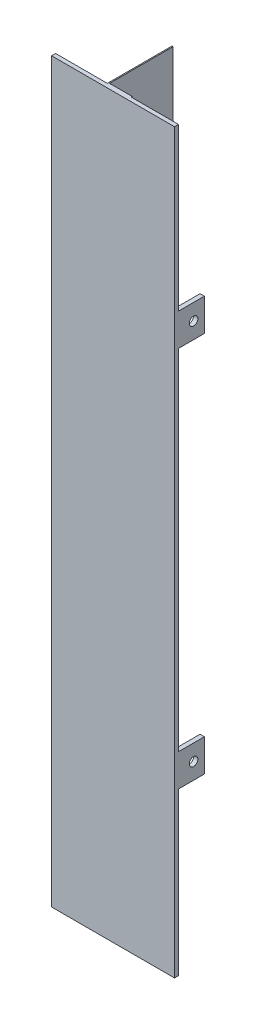
ISO-10303-21;
HEADER;
FILE_DESCRIPTION(('STEP AP214'),'2;1');
FILE_NAME('part.step','',(''),(''),'','','');
FILE_SCHEMA(('AUTOMOTIVE_DESIGN { 1 0 10303 214 1 1 1 1 }'));
ENDSEC;
DATA;
#1=APPLICATION_CONTEXT('core data for automotive mechanical design processes');
#2=APPLICATION_PROTOCOL_DEFINITION('international standard','automotive_design',2000,#1);
#3=PRODUCT_CONTEXT('',#1,'mechanical');
#4=PRODUCT('Part','Part','',(#3));
#5=PRODUCT_RELATED_PRODUCT_CATEGORY('part','',(#4));
#6=PRODUCT_DEFINITION_FORMATION('','',#4);
#7=PRODUCT_DEFINITION_CONTEXT('part definition',#1,'design');
#8=PRODUCT_DEFINITION('design','',#6,#7);
#9=PRODUCT_DEFINITION_SHAPE('','',#8);
#10=(LENGTH_UNIT() NAMED_UNIT(*) SI_UNIT(.MILLI.,.METRE.));
#11=(NAMED_UNIT(*) PLANE_ANGLE_UNIT() SI_UNIT($,.RADIAN.));
#12=(NAMED_UNIT(*) SI_UNIT($,.STERADIAN.) SOLID_ANGLE_UNIT());
#13=UNCERTAINTY_MEASURE_WITH_UNIT(LENGTH_MEASURE(1.E-05),#10,'distance_accuracy_value','');
#14=(GEOMETRIC_REPRESENTATION_CONTEXT(3) GLOBAL_UNCERTAINTY_ASSIGNED_CONTEXT((#13)) GLOBAL_UNIT_ASSIGNED_CONTEXT((#10,
#11,#12)) REPRESENTATION_CONTEXT('',''));
#15=CARTESIAN_POINT('',(0.,0.,0.));
#16=DIRECTION('',(0.,0.,1.));
#17=DIRECTION('',(1.,0.,0.));
#18=AXIS2_PLACEMENT_3D('',#15,#16,#17);
#19=CARTESIAN_POINT('',(0.,342.,-1.85));
#20=DIRECTION('',(0.,0.,1.));
#21=DIRECTION('',(1.,0.,0.));
#22=AXIS2_PLACEMENT_3D('',#19,#20,#21);
#23=PLANE('',#22);
#24=DIRECTION('',(1.,0.,0.));
#25=VECTOR('',#24,1.);
#26=CARTESIAN_POINT('',(0.,267.,-1.85));
#27=LINE('',#26,#25);
#28=CARTESIAN_POINT('',(0.,267.,-1.85));
#29=VERTEX_POINT('',#28);
#30=CARTESIAN_POINT('',(2.,267.,-1.85));
#31=VERTEX_POINT('',#30);
#32=EDGE_CURVE('E398',#29,#31,#27,.T.);
#33=ORIENTED_EDGE('',*,*,#32,.F.);
#34=DIRECTION('',(0.,-1.,0.));
#35=VECTOR('',#34,1.);
#36=CARTESIAN_POINT('',(0.,342.,-1.85));
#37=LINE('',#36,#35);
#38=CARTESIAN_POINT('',(0.,342.,-1.85));
#39=VERTEX_POINT('',#38);
#40=EDGE_CURVE('E230',#39,#29,#37,.T.);
#41=ORIENTED_EDGE('',*,*,#40,.F.);
#42=DIRECTION('',(-1.,0.,0.));
#43=VECTOR('',#42,1.);
#44=CARTESIAN_POINT('',(0.,342.,-1.85));
#45=LINE('',#44,#43);
#46=CARTESIAN_POINT('',(24.,342.,-1.85));
#47=VERTEX_POINT('',#46);
#48=EDGE_CURVE('E340',#47,#39,#45,.T.);
#49=ORIENTED_EDGE('',*,*,#48,.F.);
#50=DIRECTION('',(0.,-1.,0.));
#51=VECTOR('',#50,1.);
#52=CARTESIAN_POINT('',(24.,342.,-1.85));
#53=LINE('',#52,#51);
#54=CARTESIAN_POINT('',(24.,0.,-1.85));
#55=VERTEX_POINT('',#54);
#56=EDGE_CURVE('E370',#47,#55,#53,.T.);
#57=ORIENTED_EDGE('',*,*,#56,.T.);
#58=DIRECTION('',(-1.,0.,0.));
#59=VECTOR('',#58,1.);
#60=CARTESIAN_POINT('',(0.,0.,-1.85));
#61=LINE('',#60,#59);
#62=CARTESIAN_POINT('',(0.,0.,-1.85));
#63=VERTEX_POINT('',#62);
#64=EDGE_CURVE('E362',#55,#63,#61,.T.);
#65=ORIENTED_EDGE('',*,*,#64,.T.);
#66=CARTESIAN_POINT('',(0.,75.,-1.85));
#67=VERTEX_POINT('',#66);
#68=EDGE_CURVE('E368',#67,#63,#37,.T.);
#69=ORIENTED_EDGE('',*,*,#68,.F.);
#70=DIRECTION('',(-1.,0.,0.));
#71=VECTOR('',#70,1.);
#72=CARTESIAN_POINT('',(0.,75.,-1.85));
#73=LINE('',#72,#71);
#74=CARTESIAN_POINT('',(2.,75.,-1.85));
#75=VERTEX_POINT('',#74);
#76=EDGE_CURVE('E243',#75,#67,#73,.T.);
#77=ORIENTED_EDGE('',*,*,#76,.F.);
#78=DIRECTION('',(0.,-1.,0.));
#79=VECTOR('',#78,1.);
#80=CARTESIAN_POINT('',(2.,75.,-1.85));
#81=LINE('',#80,#79);
#82=CARTESIAN_POINT('',(2.,90.,-1.85));
#83=VERTEX_POINT('',#82);
#84=EDGE_CURVE('E233',#83,#75,#81,.T.);
#85=ORIENTED_EDGE('',*,*,#84,.F.);
#86=DIRECTION('',(1.,0.,0.));
#87=VECTOR('',#86,1.);
#88=CARTESIAN_POINT('',(0.,90.,-1.85));
#89=LINE('',#88,#87);
#90=CARTESIAN_POINT('',(0.,90.,-1.85));
#91=VERTEX_POINT('',#90);
#92=EDGE_CURVE('E231',#91,#83,#89,.T.);
#93=ORIENTED_EDGE('',*,*,#92,.F.);
#94=CARTESIAN_POINT('',(0.,252.,-1.85));
#95=VERTEX_POINT('',#94);
#96=EDGE_CURVE('E371',#95,#91,#37,.T.);
#97=ORIENTED_EDGE('',*,*,#96,.F.);
#98=DIRECTION('',(-1.,0.,0.));
#99=VECTOR('',#98,1.);
#100=CARTESIAN_POINT('',(0.,252.,-1.85));
#101=LINE('',#100,#99);
#102=CARTESIAN_POINT('',(2.,252.,-1.85));
#103=VERTEX_POINT('',#102);
#104=EDGE_CURVE('E224',#103,#95,#101,.T.);
#105=ORIENTED_EDGE('',*,*,#104,.F.);
#106=DIRECTION('',(0.,-1.,0.));
#107=VECTOR('',#106,1.);
#108=CARTESIAN_POINT('',(2.,252.,-1.85));
#109=LINE('',#108,#107);
#110=EDGE_CURVE('E421',#31,#103,#109,.T.);
#111=ORIENTED_EDGE('',*,*,#110,.F.);
#112=EDGE_LOOP('',(#33,#41,#49,#57,#65,#69,#77,#85,#93,#97,#105,#111));
#113=FACE_BOUND('',#112,.T.);
#114=ADVANCED_FACE('F33',(#113),#23,.F.);
#115=CARTESIAN_POINT('',(35.,342.,-1.85));
#116=DIRECTION('',(0.,0.,1.));
#117=DIRECTION('',(1.,0.,0.));
#118=AXIS2_PLACEMENT_3D('',#115,#116,#117);
#119=PLANE('',#118);
#120=DIRECTION('',(-1.,0.,0.));
#121=VECTOR('',#120,1.);
#122=CARTESIAN_POINT('',(57.,252.,-1.85000000000001));
#123=LINE('',#122,#121);
#124=CARTESIAN_POINT('',(57.,252.,-1.85000000000001));
#125=VERTEX_POINT('',#124);
#126=CARTESIAN_POINT('',(55.,252.,-1.85));
#127=VERTEX_POINT('',#126);
#128=EDGE_CURVE('E261',#125,#127,#123,.T.);
#129=ORIENTED_EDGE('',*,*,#128,.F.);
#130=DIRECTION('',(0.,-1.,0.));
#131=VECTOR('',#130,1.);
#132=CARTESIAN_POINT('',(57.,342.,-1.85));
#133=LINE('',#132,#131);
#134=CARTESIAN_POINT('',(57.,90.,-1.85000000000001));
#135=VERTEX_POINT('',#134);
#136=EDGE_CURVE('E390',#125,#135,#133,.T.);
#137=ORIENTED_EDGE('',*,*,#136,.T.);
#138=DIRECTION('',(1.,0.,0.));
#139=VECTOR('',#138,1.);
#140=CARTESIAN_POINT('',(57.,90.,-1.85000000000001));
#141=LINE('',#140,#139);
#142=CARTESIAN_POINT('',(55.,90.,-1.85));
#143=VERTEX_POINT('',#142);
#144=EDGE_CURVE('E296',#143,#135,#141,.T.);
#145=ORIENTED_EDGE('',*,*,#144,.F.);
#146=DIRECTION('',(0.,1.,0.));
#147=VECTOR('',#146,1.);
#148=CARTESIAN_POINT('',(55.,75.,-1.85000000000001));
#149=LINE('',#148,#147);
#150=CARTESIAN_POINT('',(55.,75.,-1.85));
#151=VERTEX_POINT('',#150);
#152=EDGE_CURVE('E305',#151,#143,#149,.T.);
#153=ORIENTED_EDGE('',*,*,#152,.F.);
#154=DIRECTION('',(-1.,0.,0.));
#155=VECTOR('',#154,1.);
#156=CARTESIAN_POINT('',(57.,75.,-1.85000000000001));
#157=LINE('',#156,#155);
#158=CARTESIAN_POINT('',(57.,75.,-1.85));
#159=VERTEX_POINT('',#158);
#160=EDGE_CURVE('E291',#159,#151,#157,.T.);
#161=ORIENTED_EDGE('',*,*,#160,.F.);
#162=CARTESIAN_POINT('',(57.,0.,-1.85));
#163=VERTEX_POINT('',#162);
#164=EDGE_CURVE('E389',#159,#163,#133,.T.);
#165=ORIENTED_EDGE('',*,*,#164,.T.);
#166=DIRECTION('',(-1.,0.,0.));
#167=VECTOR('',#166,1.);
#168=CARTESIAN_POINT('',(35.,0.,-1.85));
#169=LINE('',#168,#167);
#170=CARTESIAN_POINT('',(35.,0.,-1.85));
#171=VERTEX_POINT('',#170);
#172=EDGE_CURVE('E350',#163,#171,#169,.T.);
#173=ORIENTED_EDGE('',*,*,#172,.T.);
#174=DIRECTION('',(0.,-1.,0.));
#175=VECTOR('',#174,1.);
#176=CARTESIAN_POINT('',(35.,342.,-1.85));
#177=LINE('',#176,#175);
#178=CARTESIAN_POINT('',(35.,342.,-1.85));
#179=VERTEX_POINT('',#178);
#180=EDGE_CURVE('E386',#179,#171,#177,.T.);
#181=ORIENTED_EDGE('',*,*,#180,.F.);
#182=DIRECTION('',(-1.,0.,0.));
#183=VECTOR('',#182,1.);
#184=CARTESIAN_POINT('',(35.,342.,-1.85));
#185=LINE('',#184,#183);
#186=CARTESIAN_POINT('',(57.,342.,-1.85));
#187=VERTEX_POINT('',#186);
#188=EDGE_CURVE('E328',#187,#179,#185,.T.);
#189=ORIENTED_EDGE('',*,*,#188,.F.);
#190=CARTESIAN_POINT('',(57.,267.,-1.85));
#191=VERTEX_POINT('',#190);
#192=EDGE_CURVE('E42',#187,#191,#133,.T.);
#193=ORIENTED_EDGE('',*,*,#192,.T.);
#194=DIRECTION('',(1.,0.,0.));
#195=VECTOR('',#194,1.);
#196=CARTESIAN_POINT('',(57.,267.,-1.85000000000001));
#197=LINE('',#196,#195);
#198=CARTESIAN_POINT('',(55.,267.,-1.85));
#199=VERTEX_POINT('',#198);
#200=EDGE_CURVE('E266',#199,#191,#197,.T.);
#201=ORIENTED_EDGE('',*,*,#200,.F.);
#202=DIRECTION('',(0.,1.,0.));
#203=VECTOR('',#202,1.);
#204=CARTESIAN_POINT('',(55.,252.,-1.85000000000001));
#205=LINE('',#204,#203);
#206=EDGE_CURVE('E275',#127,#199,#205,.T.);
#207=ORIENTED_EDGE('',*,*,#206,.F.);
#208=EDGE_LOOP('',(#129,#137,#145,#153,#161,#165,#173,#181,#189,#193,#201,#207));
#209=FACE_BOUND('',#208,.T.);
#210=ADVANCED_FACE('F466',(#209),#119,.F.);
#211=CARTESIAN_POINT('',(57.,342.,0.));
#212=DIRECTION('',(0.,0.,-1.));
#213=DIRECTION('',(-1.,0.,0.));
#214=AXIS2_PLACEMENT_3D('',#211,#212,#213);
#215=PLANE('',#214);
#216=DIRECTION('',(1.,0.,0.));
#217=VECTOR('',#216,1.);
#218=CARTESIAN_POINT('',(57.,0.,0.));
#219=LINE('',#218,#217);
#220=CARTESIAN_POINT('',(0.,0.,0.));
#221=VERTEX_POINT('',#220);
#222=CARTESIAN_POINT('',(57.,0.,0.));
#223=VERTEX_POINT('',#222);
#224=EDGE_CURVE('E321',#221,#223,#219,.T.);
#225=ORIENTED_EDGE('',*,*,#224,.T.);
#226=DIRECTION('',(0.,-1.,0.));
#227=VECTOR('',#226,1.);
#228=CARTESIAN_POINT('',(57.,342.,0.));
#229=LINE('',#228,#227);
#230=CARTESIAN_POINT('',(57.,342.,0.));
#231=VERTEX_POINT('',#230);
#232=EDGE_CURVE('E11',#231,#223,#229,.T.);
#233=ORIENTED_EDGE('',*,*,#232,.F.);
#234=DIRECTION('',(1.,0.,0.));
#235=VECTOR('',#234,1.);
#236=CARTESIAN_POINT('',(57.,342.,0.));
#237=LINE('',#236,#235);
#238=CARTESIAN_POINT('',(0.,342.,0.));
#239=VERTEX_POINT('',#238);
#240=EDGE_CURVE('E322',#239,#231,#237,.T.);
#241=ORIENTED_EDGE('',*,*,#240,.F.);
#242=DIRECTION('',(0.,-1.,0.));
#243=VECTOR('',#242,1.);
#244=CARTESIAN_POINT('',(0.,342.,0.));
#245=LINE('',#244,#243);
#246=EDGE_CURVE('E344',#239,#221,#245,.T.);
#247=ORIENTED_EDGE('',*,*,#246,.T.);
#248=EDGE_LOOP('',(#225,#233,#241,#247));
#249=FACE_BOUND('',#248,.T.);
#250=ADVANCED_FACE('F35',(#249),#215,.F.);
#251=CARTESIAN_POINT('',(57.,342.,-1.85));
#252=DIRECTION('',(-1.,0.,0.));
#253=DIRECTION('',(0.,0.,1.));
#254=AXIS2_PLACEMENT_3D('',#251,#252,#253);
#255=PLANE('',#254);
#256=CARTESIAN_POINT('',(57.,259.5,-8.85));
#257=DIRECTION('',(1.,0.,0.));
#258=DIRECTION('',(0.,0.,-1.));
#259=AXIS2_PLACEMENT_3D('',#256,#257,#258);
#260=CIRCLE('',#259,2.00000000000001);
#261=CARTESIAN_POINT('',(57.,259.5,-10.85));
#262=VERTEX_POINT('',#261);
#263=EDGE_CURVE('E401',#262,#262,#260,.T.);
#264=ORIENTED_EDGE('',*,*,#263,.F.);
#265=EDGE_LOOP('',(#264));
#266=FACE_BOUND('',#265,.T.);
#267=CARTESIAN_POINT('',(57.,82.5,-8.85));
#268=DIRECTION('',(1.,0.,0.));
#269=DIRECTION('',(0.,0.,-1.));
#270=AXIS2_PLACEMENT_3D('',#267,#268,#269);
#271=CIRCLE('',#270,2.);
#272=CARTESIAN_POINT('',(57.,82.5,-10.85));
#273=VERTEX_POINT('',#272);
#274=EDGE_CURVE('E407',#273,#273,#271,.T.);
#275=ORIENTED_EDGE('',*,*,#274,.F.);
#276=EDGE_LOOP('',(#275));
#277=FACE_BOUND('',#276,.T.);
#278=DIRECTION('',(0.,0.,-1.));
#279=VECTOR('',#278,1.);
#280=CARTESIAN_POINT('',(57.,0.,-1.85));
#281=LINE('',#280,#279);
#282=EDGE_CURVE('E347',#223,#163,#281,.T.);
#283=ORIENTED_EDGE('',*,*,#282,.T.);
#284=ORIENTED_EDGE('',*,*,#164,.F.);
#285=DIRECTION('',(0.,0.,1.));
#286=VECTOR('',#285,1.);
#287=CARTESIAN_POINT('',(57.,75.,-13.85));
#288=LINE('',#287,#286);
#289=CARTESIAN_POINT('',(57.,75.,-13.85));
#290=VERTEX_POINT('',#289);
#291=EDGE_CURVE('E318',#290,#159,#288,.T.);
#292=ORIENTED_EDGE('',*,*,#291,.F.);
#293=DIRECTION('',(0.,-1.,0.));
#294=VECTOR('',#293,1.);
#295=CARTESIAN_POINT('',(57.,75.,-13.85));
#296=LINE('',#295,#294);
#297=CARTESIAN_POINT('',(57.,90.,-13.85));
#298=VERTEX_POINT('',#297);
#299=EDGE_CURVE('E292',#298,#290,#296,.T.);
#300=ORIENTED_EDGE('',*,*,#299,.F.);
#301=DIRECTION('',(0.,0.,1.));
#302=VECTOR('',#301,1.);
#303=CARTESIAN_POINT('',(57.,90.,-13.85));
#304=LINE('',#303,#302);
#305=EDGE_CURVE('E302',#298,#135,#304,.T.);
#306=ORIENTED_EDGE('',*,*,#305,.T.);
#307=ORIENTED_EDGE('',*,*,#136,.F.);
#308=DIRECTION('',(0.,0.,1.));
#309=VECTOR('',#308,1.);
#310=CARTESIAN_POINT('',(57.,252.,-13.85));
#311=LINE('',#310,#309);
#312=CARTESIAN_POINT('',(57.,252.,-13.85));
#313=VERTEX_POINT('',#312);
#314=EDGE_CURVE('E288',#313,#125,#311,.T.);
#315=ORIENTED_EDGE('',*,*,#314,.F.);
#316=DIRECTION('',(0.,-1.,0.));
#317=VECTOR('',#316,1.);
#318=CARTESIAN_POINT('',(57.,252.,-13.85));
#319=LINE('',#318,#317);
#320=CARTESIAN_POINT('',(57.,267.,-13.85));
#321=VERTEX_POINT('',#320);
#322=EDGE_CURVE('E262',#321,#313,#319,.T.);
#323=ORIENTED_EDGE('',*,*,#322,.F.);
#324=DIRECTION('',(0.,0.,1.));
#325=VECTOR('',#324,1.);
#326=CARTESIAN_POINT('',(57.,267.,-13.85));
#327=LINE('',#326,#325);
#328=EDGE_CURVE('E272',#321,#191,#327,.T.);
#329=ORIENTED_EDGE('',*,*,#328,.T.);
#330=ORIENTED_EDGE('',*,*,#192,.F.);
#331=DIRECTION('',(0.,0.,-1.));
#332=VECTOR('',#331,1.);
#333=CARTESIAN_POINT('',(57.,342.,-1.85));
#334=LINE('',#333,#332);
#335=EDGE_CURVE('E325',#231,#187,#334,.T.);
#336=ORIENTED_EDGE('',*,*,#335,.F.);
#337=ORIENTED_EDGE('',*,*,#232,.T.);
#338=EDGE_LOOP('',(#283,#284,#292,#300,#306,#307,#315,#323,#329,#330,#336,#337));
#339=FACE_BOUND('',#338,.T.);
#340=ADVANCED_FACE('F494',(#266,#277,#339),#255,.F.);
#341=CARTESIAN_POINT('',(35.,342.,-2.35));
#342=DIRECTION('',(-1.,0.,0.));
#343=DIRECTION('',(0.,0.,1.));
#344=AXIS2_PLACEMENT_3D('',#341,#342,#343);
#345=PLANE('',#344);
#346=DIRECTION('',(0.,0.,-1.));
#347=VECTOR('',#346,1.);
#348=CARTESIAN_POINT('',(35.,0.,-2.35));
#349=LINE('',#348,#347);
#350=CARTESIAN_POINT('',(35.,0.,-2.35));
#351=VERTEX_POINT('',#350);
#352=EDGE_CURVE('E352',#171,#351,#349,.T.);
#353=ORIENTED_EDGE('',*,*,#352,.T.);
#354=DIRECTION('',(0.,-1.,0.));
#355=VECTOR('',#354,1.);
#356=CARTESIAN_POINT('',(35.,342.,-2.35));
#357=LINE('',#356,#355);
#358=CARTESIAN_POINT('',(35.,342.,-2.35));
#359=VERTEX_POINT('',#358);
#360=EDGE_CURVE('E383',#359,#351,#357,.T.);
#361=ORIENTED_EDGE('',*,*,#360,.F.);
#362=DIRECTION('',(0.,0.,-1.));
#363=VECTOR('',#362,1.);
#364=CARTESIAN_POINT('',(35.,342.,-2.35));
#365=LINE('',#364,#363);
#366=EDGE_CURVE('E330',#179,#359,#365,.T.);
#367=ORIENTED_EDGE('',*,*,#366,.F.);
#368=ORIENTED_EDGE('',*,*,#180,.T.);
#369=EDGE_LOOP('',(#353,#361,#367,#368));
#370=FACE_BOUND('',#369,.T.);
#371=ADVANCED_FACE('F491',(#370),#345,.F.);
#372=CARTESIAN_POINT('',(24.5,342.,-2.35));
#373=DIRECTION('',(0.,0.,1.));
#374=DIRECTION('',(1.,0.,0.));
#375=AXIS2_PLACEMENT_3D('',#372,#373,#374);
#376=PLANE('',#375);
#377=DIRECTION('',(-1.,0.,0.));
#378=VECTOR('',#377,1.);
#379=CARTESIAN_POINT('',(24.5,0.,-2.35));
#380=LINE('',#379,#378);
#381=CARTESIAN_POINT('',(24.5,0.,-2.35));
#382=VERTEX_POINT('',#381);
#383=EDGE_CURVE('E354',#351,#382,#380,.T.);
#384=ORIENTED_EDGE('',*,*,#383,.T.);
#385=DIRECTION('',(0.,-1.,0.));
#386=VECTOR('',#385,1.);
#387=CARTESIAN_POINT('',(24.5,342.,-2.35));
#388=LINE('',#387,#386);
#389=CARTESIAN_POINT('',(24.5,342.,-2.35));
#390=VERTEX_POINT('',#389);
#391=EDGE_CURVE('E380',#390,#382,#388,.T.);
#392=ORIENTED_EDGE('',*,*,#391,.F.);
#393=DIRECTION('',(-1.,0.,0.));
#394=VECTOR('',#393,1.);
#395=CARTESIAN_POINT('',(24.5,342.,-2.35));
#396=LINE('',#395,#394);
#397=EDGE_CURVE('E332',#359,#390,#396,.T.);
#398=ORIENTED_EDGE('',*,*,#397,.F.);
#399=ORIENTED_EDGE('',*,*,#360,.T.);
#400=EDGE_LOOP('',(#384,#392,#398,#399));
#401=FACE_BOUND('',#400,.T.);
#402=ADVANCED_FACE('F487',(#401),#376,.F.);
#403=CARTESIAN_POINT('',(24.5,342.,-31.85));
#404=DIRECTION('',(-1.,0.,0.));
#405=DIRECTION('',(0.,0.,1.));
#406=AXIS2_PLACEMENT_3D('',#403,#404,#405);
#407=PLANE('',#406);
#408=DIRECTION('',(0.,0.,-1.));
#409=VECTOR('',#408,1.);
#410=CARTESIAN_POINT('',(24.5,0.,-31.85));
#411=LINE('',#410,#409);
#412=CARTESIAN_POINT('',(24.5,0.,-31.85));
#413=VERTEX_POINT('',#412);
#414=EDGE_CURVE('E356',#382,#413,#411,.T.);
#415=ORIENTED_EDGE('',*,*,#414,.T.);
#416=DIRECTION('',(0.,-1.,0.));
#417=VECTOR('',#416,1.);
#418=CARTESIAN_POINT('',(24.5,342.,-31.85));
#419=LINE('',#418,#417);
#420=CARTESIAN_POINT('',(24.5,342.,-31.85));
#421=VERTEX_POINT('',#420);
#422=EDGE_CURVE('E377',#421,#413,#419,.T.);
#423=ORIENTED_EDGE('',*,*,#422,.F.);
#424=DIRECTION('',(0.,0.,-1.));
#425=VECTOR('',#424,1.);
#426=CARTESIAN_POINT('',(24.5,342.,-31.85));
#427=LINE('',#426,#425);
#428=EDGE_CURVE('E334',#390,#421,#427,.T.);
#429=ORIENTED_EDGE('',*,*,#428,.F.);
#430=ORIENTED_EDGE('',*,*,#391,.T.);
#431=EDGE_LOOP('',(#415,#423,#429,#430));
#432=FACE_BOUND('',#431,.T.);
#433=ADVANCED_FACE('F483',(#432),#407,.F.);
#434=CARTESIAN_POINT('',(24.,342.,-31.85));
#435=DIRECTION('',(0.,0.,1.));
#436=DIRECTION('',(1.,0.,0.));
#437=AXIS2_PLACEMENT_3D('',#434,#435,#436);
#438=PLANE('',#437);
#439=DIRECTION('',(-1.,0.,0.));
#440=VECTOR('',#439,1.);
#441=CARTESIAN_POINT('',(24.,0.,-31.85));
#442=LINE('',#441,#440);
#443=CARTESIAN_POINT('',(24.,0.,-31.85));
#444=VERTEX_POINT('',#443);
#445=EDGE_CURVE('E358',#413,#444,#442,.T.);
#446=ORIENTED_EDGE('',*,*,#445,.T.);
#447=DIRECTION('',(0.,-1.,0.));
#448=VECTOR('',#447,1.);
#449=CARTESIAN_POINT('',(24.,342.,-31.85));
#450=LINE('',#449,#448);
#451=CARTESIAN_POINT('',(24.,342.,-31.85));
#452=VERTEX_POINT('',#451);
#453=EDGE_CURVE('E374',#452,#444,#450,.T.);
#454=ORIENTED_EDGE('',*,*,#453,.F.);
#455=DIRECTION('',(-1.,0.,0.));
#456=VECTOR('',#455,1.);
#457=CARTESIAN_POINT('',(24.,342.,-31.85));
#458=LINE('',#457,#456);
#459=EDGE_CURVE('E336',#421,#452,#458,.T.);
#460=ORIENTED_EDGE('',*,*,#459,.F.);
#461=ORIENTED_EDGE('',*,*,#422,.T.);
#462=EDGE_LOOP('',(#446,#454,#460,#461));
#463=FACE_BOUND('',#462,.T.);
#464=ADVANCED_FACE('F479',(#463),#438,.F.);
#465=CARTESIAN_POINT('',(24.,342.,-1.85));
#466=DIRECTION('',(1.,0.,0.));
#467=DIRECTION('',(0.,0.,-1.));
#468=AXIS2_PLACEMENT_3D('',#465,#466,#467);
#469=PLANE('',#468);
#470=DIRECTION('',(0.,0.,1.));
#471=VECTOR('',#470,1.);
#472=CARTESIAN_POINT('',(24.,0.,-1.85));
#473=LINE('',#472,#471);
#474=EDGE_CURVE('E360',#444,#55,#473,.T.);
#475=ORIENTED_EDGE('',*,*,#474,.T.);
#476=ORIENTED_EDGE('',*,*,#56,.F.);
#477=DIRECTION('',(0.,0.,1.));
#478=VECTOR('',#477,1.);
#479=CARTESIAN_POINT('',(24.,342.,-1.85));
#480=LINE('',#479,#478);
#481=EDGE_CURVE('E338',#452,#47,#480,.T.);
#482=ORIENTED_EDGE('',*,*,#481,.F.);
#483=ORIENTED_EDGE('',*,*,#453,.T.);
#484=EDGE_LOOP('',(#475,#476,#482,#483));
#485=FACE_BOUND('',#484,.T.);
#486=ADVANCED_FACE('F476',(#485),#469,.F.);
#487=CARTESIAN_POINT('',(0.,342.,0.));
#488=DIRECTION('',(1.,0.,0.));
#489=DIRECTION('',(0.,0.,-1.));
#490=AXIS2_PLACEMENT_3D('',#487,#488,#489);
#491=PLANE('',#490);
#492=CARTESIAN_POINT('',(0.,82.5,-8.85));
#493=DIRECTION('',(-1.,0.,0.));
#494=DIRECTION('',(0.,0.,1.));
#495=AXIS2_PLACEMENT_3D('',#492,#493,#494);
#496=CIRCLE('',#495,2.);
#497=CARTESIAN_POINT('',(0.,82.5,-6.85));
#498=VERTEX_POINT('',#497);
#499=EDGE_CURVE('E396',#498,#498,#496,.T.);
#500=ORIENTED_EDGE('',*,*,#499,.F.);
#501=EDGE_LOOP('',(#500));
#502=FACE_BOUND('',#501,.T.);
#503=CARTESIAN_POINT('',(0.,259.5,-8.85));
#504=DIRECTION('',(-1.,0.,0.));
#505=DIRECTION('',(0.,0.,1.));
#506=AXIS2_PLACEMENT_3D('',#503,#504,#505);
#507=CIRCLE('',#506,2.);
#508=CARTESIAN_POINT('',(0.,259.5,-6.85));
#509=VERTEX_POINT('',#508);
#510=EDGE_CURVE('E405',#509,#509,#507,.T.);
#511=ORIENTED_EDGE('',*,*,#510,.F.);
#512=EDGE_LOOP('',(#511));
#513=FACE_BOUND('',#512,.T.);
#514=DIRECTION('',(0.,0.,1.));
#515=VECTOR('',#514,1.);
#516=CARTESIAN_POINT('',(0.,0.,0.));
#517=LINE('',#516,#515);
#518=EDGE_CURVE('E326',#63,#221,#517,.T.);
#519=ORIENTED_EDGE('',*,*,#518,.T.);
#520=ORIENTED_EDGE('',*,*,#246,.F.);
#521=DIRECTION('',(0.,0.,1.));
#522=VECTOR('',#521,1.);
#523=CARTESIAN_POINT('',(0.,342.,0.));
#524=LINE('',#523,#522);
#525=EDGE_CURVE('E342',#39,#239,#524,.T.);
#526=ORIENTED_EDGE('',*,*,#525,.F.);
#527=ORIENTED_EDGE('',*,*,#40,.T.);
#528=DIRECTION('',(0.,0.,1.));
#529=VECTOR('',#528,1.);
#530=CARTESIAN_POINT('',(0.,267.,-13.85));
#531=LINE('',#530,#529);
#532=CARTESIAN_POINT('',(0.,267.,-13.85));
#533=VERTEX_POINT('',#532);
#534=EDGE_CURVE('E212',#533,#29,#531,.T.);
#535=ORIENTED_EDGE('',*,*,#534,.F.);
#536=DIRECTION('',(0.,1.,0.));
#537=VECTOR('',#536,1.);
#538=CARTESIAN_POINT('',(0.,252.,-13.85));
#539=LINE('',#538,#537);
#540=CARTESIAN_POINT('',(0.,252.,-13.85));
#541=VERTEX_POINT('',#540);
#542=EDGE_CURVE('E219',#541,#533,#539,.T.);
#543=ORIENTED_EDGE('',*,*,#542,.F.);
#544=DIRECTION('',(0.,0.,1.));
#545=VECTOR('',#544,1.);
#546=CARTESIAN_POINT('',(0.,252.,-13.85));
#547=LINE('',#546,#545);
#548=EDGE_CURVE('E50',#541,#95,#547,.T.);
#549=ORIENTED_EDGE('',*,*,#548,.T.);
#550=ORIENTED_EDGE('',*,*,#96,.T.);
#551=DIRECTION('',(0.,0.,1.));
#552=VECTOR('',#551,1.);
#553=CARTESIAN_POINT('',(0.,90.,-13.85));
#554=LINE('',#553,#552);
#555=CARTESIAN_POINT('',(0.,90.,-13.85));
#556=VERTEX_POINT('',#555);
#557=EDGE_CURVE('E258',#556,#91,#554,.T.);
#558=ORIENTED_EDGE('',*,*,#557,.F.);
#559=DIRECTION('',(0.,1.,0.));
#560=VECTOR('',#559,1.);
#561=CARTESIAN_POINT('',(0.,75.,-13.85));
#562=LINE('',#561,#560);
#563=CARTESIAN_POINT('',(0.,75.,-13.85));
#564=VERTEX_POINT('',#563);
#565=EDGE_CURVE('E239',#564,#556,#562,.T.);
#566=ORIENTED_EDGE('',*,*,#565,.F.);
#567=DIRECTION('',(0.,0.,1.));
#568=VECTOR('',#567,1.);
#569=CARTESIAN_POINT('',(0.,75.,-13.85));
#570=LINE('',#569,#568);
#571=EDGE_CURVE('E57',#564,#67,#570,.T.);
#572=ORIENTED_EDGE('',*,*,#571,.T.);
#573=ORIENTED_EDGE('',*,*,#68,.T.);
#574=EDGE_LOOP('',(#519,#520,#526,#527,#535,#543,#549,#550,#558,#566,#572,#573));
#575=FACE_BOUND('',#574,.T.);
#576=ADVANCED_FACE('F227',(#502,#513,#575),#491,.F.);
#577=CARTESIAN_POINT('',(0.,342.,0.));
#578=DIRECTION('',(0.,-1.,0.));
#579=DIRECTION('',(0.,0.,-1.));
#580=AXIS2_PLACEMENT_3D('',#577,#578,#579);
#581=PLANE('',#580);
#582=ORIENTED_EDGE('',*,*,#240,.T.);
#583=ORIENTED_EDGE('',*,*,#335,.T.);
#584=ORIENTED_EDGE('',*,*,#188,.T.);
#585=ORIENTED_EDGE('',*,*,#366,.T.);
#586=ORIENTED_EDGE('',*,*,#397,.T.);
#587=ORIENTED_EDGE('',*,*,#428,.T.);
#588=ORIENTED_EDGE('',*,*,#459,.T.);
#589=ORIENTED_EDGE('',*,*,#481,.T.);
#590=ORIENTED_EDGE('',*,*,#48,.T.);
#591=ORIENTED_EDGE('',*,*,#525,.T.);
#592=EDGE_LOOP('',(#582,#583,#584,#585,#586,#587,#588,#589,#590,#591));
#593=FACE_BOUND('',#592,.T.);
#594=ADVANCED_FACE('F452',(#593),#581,.F.);
#595=CARTESIAN_POINT('',(0.,0.,0.));
#596=DIRECTION('',(0.,-1.,0.));
#597=DIRECTION('',(0.,0.,-1.));
#598=AXIS2_PLACEMENT_3D('',#595,#596,#597);
#599=PLANE('',#598);
#600=ORIENTED_EDGE('',*,*,#224,.F.);
#601=ORIENTED_EDGE('',*,*,#518,.F.);
#602=ORIENTED_EDGE('',*,*,#64,.F.);
#603=ORIENTED_EDGE('',*,*,#474,.F.);
#604=ORIENTED_EDGE('',*,*,#445,.F.);
#605=ORIENTED_EDGE('',*,*,#414,.F.);
#606=ORIENTED_EDGE('',*,*,#383,.F.);
#607=ORIENTED_EDGE('',*,*,#352,.F.);
#608=ORIENTED_EDGE('',*,*,#172,.F.);
#609=ORIENTED_EDGE('',*,*,#282,.F.);
#610=EDGE_LOOP('',(#600,#601,#602,#603,#604,#605,#606,#607,#608,#609));
#611=FACE_BOUND('',#610,.T.);
#612=ADVANCED_FACE('F446',(#611),#599,.T.);
#613=CARTESIAN_POINT('',(57.,75.,-13.85));
#614=DIRECTION('',(0.,1.,0.));
#615=DIRECTION('',(-1.,0.,0.));
#616=AXIS2_PLACEMENT_3D('',#613,#614,#615);
#617=PLANE('',#616);
#618=ORIENTED_EDGE('',*,*,#160,.T.);
#619=DIRECTION('',(0.,0.,1.));
#620=VECTOR('',#619,1.);
#621=CARTESIAN_POINT('',(55.,75.,-13.85));
#622=LINE('',#621,#620);
#623=CARTESIAN_POINT('',(55.,75.,-13.85));
#624=VERTEX_POINT('',#623);
#625=EDGE_CURVE('E315',#624,#151,#622,.T.);
#626=ORIENTED_EDGE('',*,*,#625,.F.);
#627=DIRECTION('',(-1.,0.,0.));
#628=VECTOR('',#627,1.);
#629=CARTESIAN_POINT('',(57.,75.,-13.85));
#630=LINE('',#629,#628);
#631=EDGE_CURVE('E295',#290,#624,#630,.T.);
#632=ORIENTED_EDGE('',*,*,#631,.F.);
#633=ORIENTED_EDGE('',*,*,#291,.T.);
#634=EDGE_LOOP('',(#618,#626,#632,#633));
#635=FACE_BOUND('',#634,.T.);
#636=ADVANCED_FACE('F550',(#635),#617,.F.);
#637=CARTESIAN_POINT('',(55.,75.,-13.85));
#638=DIRECTION('',(1.,0.,0.));
#639=DIRECTION('',(0.,0.,-1.));
#640=AXIS2_PLACEMENT_3D('',#637,#638,#639);
#641=PLANE('',#640);
#642=CARTESIAN_POINT('',(55.,82.5,-8.85));
#643=DIRECTION('',(1.,0.,0.));
#644=DIRECTION('',(0.,0.,-1.));
#645=AXIS2_PLACEMENT_3D('',#642,#643,#644);
#646=CIRCLE('',#645,2.);
#647=CARTESIAN_POINT('',(55.,82.5,-10.85));
#648=VERTEX_POINT('',#647);
#649=EDGE_CURVE('E37',#648,#648,#646,.T.);
#650=ORIENTED_EDGE('',*,*,#649,.T.);
#651=EDGE_LOOP('',(#650));
#652=FACE_BOUND('',#651,.T.);
#653=ORIENTED_EDGE('',*,*,#152,.T.);
#654=DIRECTION('',(0.,0.,1.));
#655=VECTOR('',#654,1.);
#656=CARTESIAN_POINT('',(55.,90.,-13.85));
#657=LINE('',#656,#655);
#658=CARTESIAN_POINT('',(55.,90.,-13.85));
#659=VERTEX_POINT('',#658);
#660=EDGE_CURVE('E312',#659,#143,#657,.T.);
#661=ORIENTED_EDGE('',*,*,#660,.F.);
#662=DIRECTION('',(0.,1.,0.));
#663=VECTOR('',#662,1.);
#664=CARTESIAN_POINT('',(55.,75.,-13.85));
#665=LINE('',#664,#663);
#666=EDGE_CURVE('E298',#624,#659,#665,.T.);
#667=ORIENTED_EDGE('',*,*,#666,.F.);
#668=ORIENTED_EDGE('',*,*,#625,.T.);
#669=EDGE_LOOP('',(#653,#661,#667,#668));
#670=FACE_BOUND('',#669,.T.);
#671=ADVANCED_FACE('F546',(#652,#670),#641,.F.);
#672=CARTESIAN_POINT('',(57.,90.,-13.85));
#673=DIRECTION('',(0.,-1.,0.));
#674=DIRECTION('',(0.,0.,-1.));
#675=AXIS2_PLACEMENT_3D('',#672,#673,#674);
#676=PLANE('',#675);
#677=ORIENTED_EDGE('',*,*,#144,.T.);
#678=ORIENTED_EDGE('',*,*,#305,.F.);
#679=DIRECTION('',(1.,0.,0.));
#680=VECTOR('',#679,1.);
#681=CARTESIAN_POINT('',(57.,90.,-13.85));
#682=LINE('',#681,#680);
#683=EDGE_CURVE('E300',#659,#298,#682,.T.);
#684=ORIENTED_EDGE('',*,*,#683,.F.);
#685=ORIENTED_EDGE('',*,*,#660,.T.);
#686=EDGE_LOOP('',(#677,#678,#684,#685));
#687=FACE_BOUND('',#686,.T.);
#688=ADVANCED_FACE('F539',(#687),#676,.F.);
#689=CARTESIAN_POINT('',(0.,0.,-13.85));
#690=DIRECTION('',(0.,0.,1.));
#691=DIRECTION('',(1.,0.,0.));
#692=AXIS2_PLACEMENT_3D('',#689,#690,#691);
#693=PLANE('',#692);
#694=ORIENTED_EDGE('',*,*,#299,.T.);
#695=ORIENTED_EDGE('',*,*,#631,.T.);
#696=ORIENTED_EDGE('',*,*,#666,.T.);
#697=ORIENTED_EDGE('',*,*,#683,.T.);
#698=EDGE_LOOP('',(#694,#695,#696,#697));
#699=FACE_BOUND('',#698,.T.);
#700=ADVANCED_FACE('F532',(#699),#693,.F.);
#701=CARTESIAN_POINT('',(57.,252.,-13.85));
#702=DIRECTION('',(0.,1.,0.));
#703=DIRECTION('',(0.,0.,1.));
#704=AXIS2_PLACEMENT_3D('',#701,#702,#703);
#705=PLANE('',#704);
#706=ORIENTED_EDGE('',*,*,#128,.T.);
#707=DIRECTION('',(0.,0.,1.));
#708=VECTOR('',#707,1.);
#709=CARTESIAN_POINT('',(55.,252.,-13.85));
#710=LINE('',#709,#708);
#711=CARTESIAN_POINT('',(55.,252.,-13.85));
#712=VERTEX_POINT('',#711);
#713=EDGE_CURVE('E285',#712,#127,#710,.T.);
#714=ORIENTED_EDGE('',*,*,#713,.F.);
#715=DIRECTION('',(-1.,0.,0.));
#716=VECTOR('',#715,1.);
#717=CARTESIAN_POINT('',(57.,252.,-13.85));
#718=LINE('',#717,#716);
#719=EDGE_CURVE('E265',#313,#712,#718,.T.);
#720=ORIENTED_EDGE('',*,*,#719,.F.);
#721=ORIENTED_EDGE('',*,*,#314,.T.);
#722=EDGE_LOOP('',(#706,#714,#720,#721));
#723=FACE_BOUND('',#722,.T.);
#724=ADVANCED_FACE('F530',(#723),#705,.F.);
#725=CARTESIAN_POINT('',(55.,252.,-13.85));
#726=DIRECTION('',(1.,0.,0.));
#727=DIRECTION('',(0.,0.,-1.));
#728=AXIS2_PLACEMENT_3D('',#725,#726,#727);
#729=PLANE('',#728);
#730=CARTESIAN_POINT('',(55.,259.5,-8.85));
#731=DIRECTION('',(1.,0.,0.));
#732=DIRECTION('',(0.,0.,-1.));
#733=AXIS2_PLACEMENT_3D('',#730,#731,#732);
#734=CIRCLE('',#733,2.00000000000001);
#735=CARTESIAN_POINT('',(55.,259.5,-10.85));
#736=VERTEX_POINT('',#735);
#737=EDGE_CURVE('E399',#736,#736,#734,.T.);
#738=ORIENTED_EDGE('',*,*,#737,.T.);
#739=EDGE_LOOP('',(#738));
#740=FACE_BOUND('',#739,.T.);
#741=ORIENTED_EDGE('',*,*,#206,.T.);
#742=DIRECTION('',(0.,0.,1.));
#743=VECTOR('',#742,1.);
#744=CARTESIAN_POINT('',(55.,267.,-13.85));
#745=LINE('',#744,#743);
#746=CARTESIAN_POINT('',(55.,267.,-13.85));
#747=VERTEX_POINT('',#746);
#748=EDGE_CURVE('E282',#747,#199,#745,.T.);
#749=ORIENTED_EDGE('',*,*,#748,.F.);
#750=DIRECTION('',(0.,1.,0.));
#751=VECTOR('',#750,1.);
#752=CARTESIAN_POINT('',(55.,252.,-13.85));
#753=LINE('',#752,#751);
#754=EDGE_CURVE('E268',#712,#747,#753,.T.);
#755=ORIENTED_EDGE('',*,*,#754,.F.);
#756=ORIENTED_EDGE('',*,*,#713,.T.);
#757=EDGE_LOOP('',(#741,#749,#755,#756));
#758=FACE_BOUND('',#757,.T.);
#759=ADVANCED_FACE('F528',(#740,#758),#729,.F.);
#760=CARTESIAN_POINT('',(57.,267.,-13.85));
#761=DIRECTION('',(0.,-1.,0.));
#762=DIRECTION('',(0.,0.,-1.));
#763=AXIS2_PLACEMENT_3D('',#760,#761,#762);
#764=PLANE('',#763);
#765=ORIENTED_EDGE('',*,*,#200,.T.);
#766=ORIENTED_EDGE('',*,*,#328,.F.);
#767=DIRECTION('',(1.,0.,0.));
#768=VECTOR('',#767,1.);
#769=CARTESIAN_POINT('',(57.,267.,-13.85));
#770=LINE('',#769,#768);
#771=EDGE_CURVE('E270',#747,#321,#770,.T.);
#772=ORIENTED_EDGE('',*,*,#771,.F.);
#773=ORIENTED_EDGE('',*,*,#748,.T.);
#774=EDGE_LOOP('',(#765,#766,#772,#773));
#775=FACE_BOUND('',#774,.T.);
#776=ADVANCED_FACE('F518',(#775),#764,.F.);
#777=CARTESIAN_POINT('',(0.,0.,-13.85));
#778=DIRECTION('',(0.,0.,1.));
#779=DIRECTION('',(1.,0.,0.));
#780=AXIS2_PLACEMENT_3D('',#777,#778,#779);
#781=PLANE('',#780);
#782=ORIENTED_EDGE('',*,*,#322,.T.);
#783=ORIENTED_EDGE('',*,*,#719,.T.);
#784=ORIENTED_EDGE('',*,*,#754,.T.);
#785=ORIENTED_EDGE('',*,*,#771,.T.);
#786=EDGE_LOOP('',(#782,#783,#784,#785));
#787=FACE_BOUND('',#786,.T.);
#788=ADVANCED_FACE('F524',(#787),#781,.F.);
#789=CARTESIAN_POINT('',(0.,90.,-13.85));
#790=DIRECTION('',(0.,-1.,0.));
#791=DIRECTION('',(0.,0.,-1.));
#792=AXIS2_PLACEMENT_3D('',#789,#790,#791);
#793=PLANE('',#792);
#794=ORIENTED_EDGE('',*,*,#92,.T.);
#795=DIRECTION('',(0.,0.,1.));
#796=VECTOR('',#795,1.);
#797=CARTESIAN_POINT('',(2.,90.,-13.85));
#798=LINE('',#797,#796);
#799=CARTESIAN_POINT('',(2.,90.,-13.85));
#800=VERTEX_POINT('',#799);
#801=EDGE_CURVE('E255',#800,#83,#798,.T.);
#802=ORIENTED_EDGE('',*,*,#801,.F.);
#803=DIRECTION('',(1.,0.,0.));
#804=VECTOR('',#803,1.);
#805=CARTESIAN_POINT('',(0.,90.,-13.85));
#806=LINE('',#805,#804);
#807=EDGE_CURVE('E242',#556,#800,#806,.T.);
#808=ORIENTED_EDGE('',*,*,#807,.F.);
#809=ORIENTED_EDGE('',*,*,#557,.T.);
#810=EDGE_LOOP('',(#794,#802,#808,#809));
#811=FACE_BOUND('',#810,.T.);
#812=ADVANCED_FACE('F601',(#811),#793,.F.);
#813=CARTESIAN_POINT('',(2.,75.,-13.85));
#814=DIRECTION('',(-1.,0.,0.));
#815=DIRECTION('',(0.,0.,1.));
#816=AXIS2_PLACEMENT_3D('',#813,#814,#815);
#817=PLANE('',#816);
#818=CARTESIAN_POINT('',(2.,82.5,-8.85));
#819=DIRECTION('',(-1.,0.,0.));
#820=DIRECTION('',(0.,0.,1.));
#821=AXIS2_PLACEMENT_3D('',#818,#819,#820);
#822=CIRCLE('',#821,2.);
#823=CARTESIAN_POINT('',(2.,82.5,-6.85));
#824=VERTEX_POINT('',#823);
#825=EDGE_CURVE('E395',#824,#824,#822,.T.);
#826=ORIENTED_EDGE('',*,*,#825,.T.);
#827=EDGE_LOOP('',(#826));
#828=FACE_BOUND('',#827,.T.);
#829=ORIENTED_EDGE('',*,*,#84,.T.);
#830=DIRECTION('',(0.,0.,1.));
#831=VECTOR('',#830,1.);
#832=CARTESIAN_POINT('',(2.,75.,-13.85));
#833=LINE('',#832,#831);
#834=CARTESIAN_POINT('',(2.,75.,-13.85));
#835=VERTEX_POINT('',#834);
#836=EDGE_CURVE('E252',#835,#75,#833,.T.);
#837=ORIENTED_EDGE('',*,*,#836,.F.);
#838=DIRECTION('',(0.,-1.,0.));
#839=VECTOR('',#838,1.);
#840=CARTESIAN_POINT('',(2.,75.,-13.85));
#841=LINE('',#840,#839);
#842=EDGE_CURVE('E245',#800,#835,#841,.T.);
#843=ORIENTED_EDGE('',*,*,#842,.F.);
#844=ORIENTED_EDGE('',*,*,#801,.T.);
#845=EDGE_LOOP('',(#829,#837,#843,#844));
#846=FACE_BOUND('',#845,.T.);
#847=ADVANCED_FACE('F610',(#828,#846),#817,.F.);
#848=CARTESIAN_POINT('',(0.,75.,-13.85));
#849=DIRECTION('',(0.,1.,0.));
#850=DIRECTION('',(0.,0.,1.));
#851=AXIS2_PLACEMENT_3D('',#848,#849,#850);
#852=PLANE('',#851);
#853=ORIENTED_EDGE('',*,*,#76,.T.);
#854=ORIENTED_EDGE('',*,*,#571,.F.);
#855=DIRECTION('',(-1.,0.,0.));
#856=VECTOR('',#855,1.);
#857=CARTESIAN_POINT('',(0.,75.,-13.85));
#858=LINE('',#857,#856);
#859=EDGE_CURVE('E247',#835,#564,#858,.T.);
#860=ORIENTED_EDGE('',*,*,#859,.F.);
#861=ORIENTED_EDGE('',*,*,#836,.T.);
#862=EDGE_LOOP('',(#853,#854,#860,#861));
#863=FACE_BOUND('',#862,.T.);
#864=ADVANCED_FACE('F618',(#863),#852,.F.);
#865=CARTESIAN_POINT('',(0.,0.,-13.85));
#866=DIRECTION('',(0.,0.,-1.));
#867=DIRECTION('',(-1.,0.,0.));
#868=AXIS2_PLACEMENT_3D('',#865,#866,#867);
#869=PLANE('',#868);
#870=ORIENTED_EDGE('',*,*,#565,.T.);
#871=ORIENTED_EDGE('',*,*,#807,.T.);
#872=ORIENTED_EDGE('',*,*,#842,.T.);
#873=ORIENTED_EDGE('',*,*,#859,.T.);
#874=EDGE_LOOP('',(#870,#871,#872,#873));
#875=FACE_BOUND('',#874,.T.);
#876=ADVANCED_FACE('F463',(#875),#869,.T.);
#877=CARTESIAN_POINT('',(0.,267.,-13.85));
#878=DIRECTION('',(0.,-1.,0.));
#879=DIRECTION('',(0.,0.,-1.));
#880=AXIS2_PLACEMENT_3D('',#877,#878,#879);
#881=PLANE('',#880);
#882=ORIENTED_EDGE('',*,*,#32,.T.);
#883=DIRECTION('',(0.,0.,1.));
#884=VECTOR('',#883,1.);
#885=CARTESIAN_POINT('',(2.,267.,-13.85));
#886=LINE('',#885,#884);
#887=CARTESIAN_POINT('',(2.,267.,-13.85));
#888=VERTEX_POINT('',#887);
#889=EDGE_CURVE('E215',#888,#31,#886,.T.);
#890=ORIENTED_EDGE('',*,*,#889,.F.);
#891=DIRECTION('',(1.,0.,0.));
#892=VECTOR('',#891,1.);
#893=CARTESIAN_POINT('',(0.,267.,-13.85));
#894=LINE('',#893,#892);
#895=EDGE_CURVE('E208',#533,#888,#894,.T.);
#896=ORIENTED_EDGE('',*,*,#895,.F.);
#897=ORIENTED_EDGE('',*,*,#534,.T.);
#898=EDGE_LOOP('',(#882,#890,#896,#897));
#899=FACE_BOUND('',#898,.T.);
#900=ADVANCED_FACE('F210',(#899),#881,.F.);
#901=CARTESIAN_POINT('',(2.,252.,-13.85));
#902=DIRECTION('',(-1.,0.,0.));
#903=DIRECTION('',(0.,0.,1.));
#904=AXIS2_PLACEMENT_3D('',#901,#902,#903);
#905=PLANE('',#904);
#906=CARTESIAN_POINT('',(2.,259.5,-8.85));
#907=DIRECTION('',(-1.,0.,0.));
#908=DIRECTION('',(0.,0.,1.));
#909=AXIS2_PLACEMENT_3D('',#906,#907,#908);
#910=CIRCLE('',#909,2.);
#911=CARTESIAN_POINT('',(2.,259.5,-6.85));
#912=VERTEX_POINT('',#911);
#913=EDGE_CURVE('E392',#912,#912,#910,.T.);
#914=ORIENTED_EDGE('',*,*,#913,.T.);
#915=EDGE_LOOP('',(#914));
#916=FACE_BOUND('',#915,.T.);
#917=ORIENTED_EDGE('',*,*,#110,.T.);
#918=DIRECTION('',(0.,0.,1.));
#919=VECTOR('',#918,1.);
#920=CARTESIAN_POINT('',(2.,252.,-13.85));
#921=LINE('',#920,#919);
#922=CARTESIAN_POINT('',(2.,252.,-13.85));
#923=VERTEX_POINT('',#922);
#924=EDGE_CURVE('E235',#923,#103,#921,.T.);
#925=ORIENTED_EDGE('',*,*,#924,.F.);
#926=DIRECTION('',(0.,-1.,0.));
#927=VECTOR('',#926,1.);
#928=CARTESIAN_POINT('',(2.,252.,-13.85));
#929=LINE('',#928,#927);
#930=EDGE_CURVE('E218',#888,#923,#929,.T.);
#931=ORIENTED_EDGE('',*,*,#930,.F.);
#932=ORIENTED_EDGE('',*,*,#889,.T.);
#933=EDGE_LOOP('',(#917,#925,#931,#932));
#934=FACE_BOUND('',#933,.T.);
#935=ADVANCED_FACE('F454',(#916,#934),#905,.F.);
#936=CARTESIAN_POINT('',(0.,252.,-13.85));
#937=DIRECTION('',(0.,1.,0.));
#938=DIRECTION('',(0.,0.,1.));
#939=AXIS2_PLACEMENT_3D('',#936,#937,#938);
#940=PLANE('',#939);
#941=ORIENTED_EDGE('',*,*,#104,.T.);
#942=ORIENTED_EDGE('',*,*,#548,.F.);
#943=DIRECTION('',(-1.,0.,0.));
#944=VECTOR('',#943,1.);
#945=CARTESIAN_POINT('',(0.,252.,-13.85));
#946=LINE('',#945,#944);
#947=EDGE_CURVE('E223',#923,#541,#946,.T.);
#948=ORIENTED_EDGE('',*,*,#947,.F.);
#949=ORIENTED_EDGE('',*,*,#924,.T.);
#950=EDGE_LOOP('',(#941,#942,#948,#949));
#951=FACE_BOUND('',#950,.T.);
#952=ADVANCED_FACE('F428',(#951),#940,.F.);
#953=CARTESIAN_POINT('',(0.,0.,-13.85));
#954=DIRECTION('',(0.,0.,-1.));
#955=DIRECTION('',(-1.,0.,0.));
#956=AXIS2_PLACEMENT_3D('',#953,#954,#955);
#957=PLANE('',#956);
#958=ORIENTED_EDGE('',*,*,#542,.T.);
#959=ORIENTED_EDGE('',*,*,#895,.T.);
#960=ORIENTED_EDGE('',*,*,#930,.T.);
#961=ORIENTED_EDGE('',*,*,#947,.T.);
#962=EDGE_LOOP('',(#958,#959,#960,#961));
#963=FACE_BOUND('',#962,.T.);
#964=ADVANCED_FACE('F221',(#963),#957,.T.);
#965=CARTESIAN_POINT('',(10.,259.5,-8.85));
#966=DIRECTION('',(-1.,0.,0.));
#967=DIRECTION('',(0.,0.,1.));
#968=AXIS2_PLACEMENT_3D('',#965,#966,#967);
#969=CYLINDRICAL_SURFACE('',#968,2.);
#970=ORIENTED_EDGE('',*,*,#510,.T.);
#971=EDGE_LOOP('',(#970));
#972=FACE_BOUND('',#971,.T.);
#973=ORIENTED_EDGE('',*,*,#913,.F.);
#974=EDGE_LOOP('',(#973));
#975=FACE_BOUND('',#974,.T.);
#976=ADVANCED_FACE('F654',(#972,#975),#969,.F.);
#977=CARTESIAN_POINT('',(10.,82.5,-8.85));
#978=DIRECTION('',(-1.,0.,0.));
#979=DIRECTION('',(0.,0.,1.));
#980=AXIS2_PLACEMENT_3D('',#977,#978,#979);
#981=CYLINDRICAL_SURFACE('',#980,2.);
#982=ORIENTED_EDGE('',*,*,#499,.T.);
#983=EDGE_LOOP('',(#982));
#984=FACE_BOUND('',#983,.T.);
#985=ORIENTED_EDGE('',*,*,#825,.F.);
#986=EDGE_LOOP('',(#985));
#987=FACE_BOUND('',#986,.T.);
#988=ADVANCED_FACE('F681',(#984,#987),#981,.F.);
#989=CARTESIAN_POINT('',(47.,259.5,-8.85));
#990=DIRECTION('',(1.,0.,0.));
#991=DIRECTION('',(0.,0.,-1.));
#992=AXIS2_PLACEMENT_3D('',#989,#990,#991);
#993=CYLINDRICAL_SURFACE('',#992,2.00000000000001);
#994=ORIENTED_EDGE('',*,*,#263,.T.);
#995=EDGE_LOOP('',(#994));
#996=FACE_BOUND('',#995,.T.);
#997=ORIENTED_EDGE('',*,*,#737,.F.);
#998=EDGE_LOOP('',(#997));
#999=FACE_BOUND('',#998,.T.);
#1000=ADVANCED_FACE('F690',(#996,#999),#993,.F.);
#1001=CARTESIAN_POINT('',(47.,82.5,-8.85));
#1002=DIRECTION('',(1.,0.,0.));
#1003=DIRECTION('',(0.,0.,-1.));
#1004=AXIS2_PLACEMENT_3D('',#1001,#1002,#1003);
#1005=CYLINDRICAL_SURFACE('',#1004,2.);
#1006=ORIENTED_EDGE('',*,*,#274,.T.);
#1007=EDGE_LOOP('',(#1006));
#1008=FACE_BOUND('',#1007,.T.);
#1009=ORIENTED_EDGE('',*,*,#649,.F.);
#1010=EDGE_LOOP('',(#1009));
#1011=FACE_BOUND('',#1010,.T.);
#1012=ADVANCED_FACE('F767',(#1008,#1011),#1005,.F.);
#1013=CLOSED_SHELL('',(#114,#210,#250,#340,#371,#402,#433,#464,#486,#576,#594,#612,#636,#671,
#688,#700,#724,#759,#776,#788,#812,#847,#864,#876,#900,#935,#952,#964,#976,#988,#1000,#1012));
#1014=MANIFOLD_SOLID_BREP('B2',#1013);
#1015=ADVANCED_BREP_SHAPE_REPRESENTATION('',(#18,#1014),#14);
#1016=SHAPE_DEFINITION_REPRESENTATION(#9,#1015);
ENDSEC;
END-ISO-10303-21;
